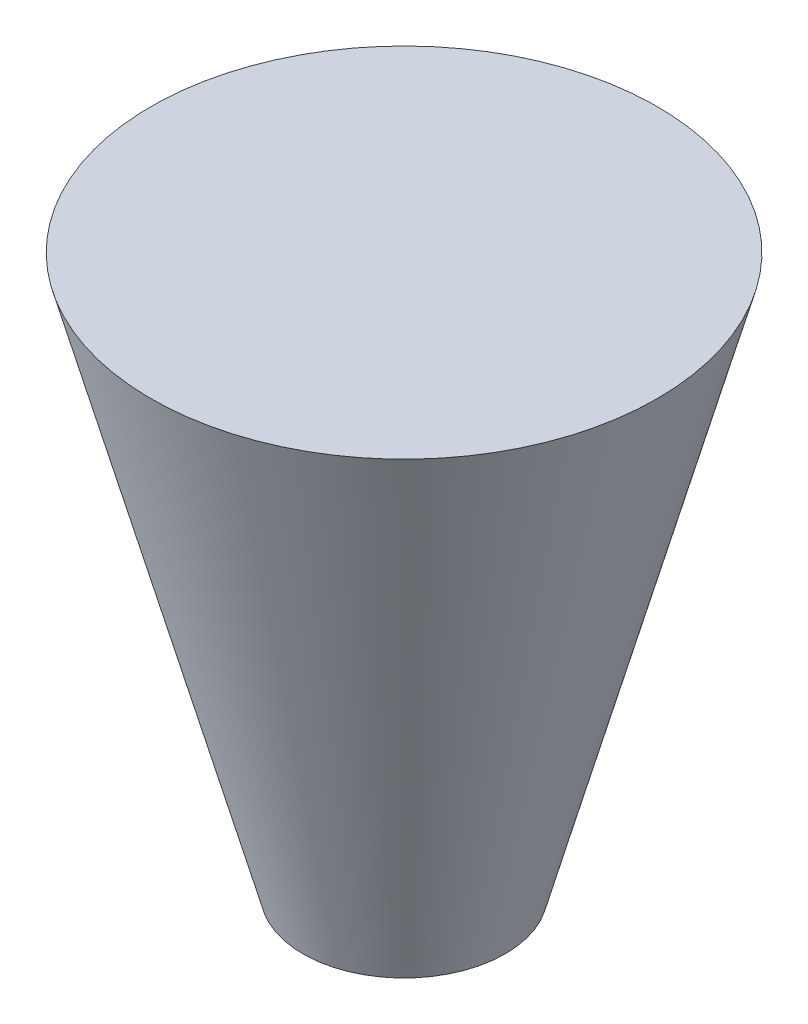
ISO-10303-21;
HEADER;
FILE_DESCRIPTION(('STEP AP214'),'2;1');
FILE_NAME('part.step','',(''),(''),'','','');
FILE_SCHEMA(('AUTOMOTIVE_DESIGN { 1 0 10303 214 1 1 1 1 }'));
ENDSEC;
DATA;
#1=APPLICATION_CONTEXT('core data for automotive mechanical design processes');
#2=APPLICATION_PROTOCOL_DEFINITION('international standard','automotive_design',2000,#1);
#3=PRODUCT_CONTEXT('',#1,'mechanical');
#4=PRODUCT('Part','Part','',(#3));
#5=PRODUCT_RELATED_PRODUCT_CATEGORY('part','',(#4));
#6=PRODUCT_DEFINITION_FORMATION('','',#4);
#7=PRODUCT_DEFINITION_CONTEXT('part definition',#1,'design');
#8=PRODUCT_DEFINITION('design','',#6,#7);
#9=PRODUCT_DEFINITION_SHAPE('','',#8);
#10=(LENGTH_UNIT() NAMED_UNIT(*) SI_UNIT(.MILLI.,.METRE.));
#11=(NAMED_UNIT(*) PLANE_ANGLE_UNIT() SI_UNIT($,.RADIAN.));
#12=(NAMED_UNIT(*) SI_UNIT($,.STERADIAN.) SOLID_ANGLE_UNIT());
#13=UNCERTAINTY_MEASURE_WITH_UNIT(LENGTH_MEASURE(1.E-05),#10,'distance_accuracy_value','');
#14=(GEOMETRIC_REPRESENTATION_CONTEXT(3) GLOBAL_UNCERTAINTY_ASSIGNED_CONTEXT((#13)) GLOBAL_UNIT_ASSIGNED_CONTEXT((#10,
#11,#12)) REPRESENTATION_CONTEXT('',''));
#15=CARTESIAN_POINT('',(0.,0.,0.));
#16=DIRECTION('',(0.,0.,1.));
#17=DIRECTION('',(1.,0.,0.));
#18=AXIS2_PLACEMENT_3D('',#15,#16,#17);
#19=CARTESIAN_POINT('',(0.,-50.,0.));
#20=DIRECTION('',(0.,1.,0.));
#21=DIRECTION('',(-1.,0.,0.));
#22=AXIS2_PLACEMENT_3D('',#19,#20,#21);
#23=PLANE('',#22);
#24=CARTESIAN_POINT('',(0.,-50.,0.));
#25=DIRECTION('',(0.,-1.,0.));
#26=DIRECTION('',(1.,0.,0.));
#27=AXIS2_PLACEMENT_3D('',#24,#25,#26);
#28=CIRCLE('',#27,20.);
#29=CARTESIAN_POINT('',(20.,-50.,0.));
#30=VERTEX_POINT('',#29);
#31=EDGE_CURVE('E10',#30,#30,#28,.T.);
#32=ORIENTED_EDGE('',*,*,#31,.T.);
#33=EDGE_LOOP('',(#32));
#34=FACE_BOUND('',#33,.T.);
#35=ADVANCED_FACE('F31',(#34),#23,.F.);
#36=CARTESIAN_POINT('',(0.,60.,0.));
#37=DIRECTION('',(0.,1.,0.));
#38=DIRECTION('',(-1.,0.,0.));
#39=AXIS2_PLACEMENT_3D('',#36,#37,#38);
#40=CONICAL_SURFACE('',#39,50.,0.266252049150925);
#41=ORIENTED_EDGE('',*,*,#31,.F.);
#42=EDGE_LOOP('',(#41));
#43=FACE_BOUND('',#42,.T.);
#44=CARTESIAN_POINT('',(0.,60.,0.));
#45=DIRECTION('',(0.,-1.,0.));
#46=DIRECTION('',(1.,0.,0.));
#47=AXIS2_PLACEMENT_3D('',#44,#45,#46);
#48=CIRCLE('',#47,50.);
#49=CARTESIAN_POINT('',(50.,60.,0.));
#50=VERTEX_POINT('',#49);
#51=EDGE_CURVE('E37',#50,#50,#48,.T.);
#52=ORIENTED_EDGE('',*,*,#51,.T.);
#53=EDGE_LOOP('',(#52));
#54=FACE_BOUND('',#53,.T.);
#55=ADVANCED_FACE('F43',(#43,#54),#40,.T.);
#56=CARTESIAN_POINT('',(-50.,60.,0.));
#57=DIRECTION('',(0.,-1.,0.));
#58=DIRECTION('',(1.,0.,0.));
#59=AXIS2_PLACEMENT_3D('',#56,#57,#58);
#60=PLANE('',#59);
#61=ORIENTED_EDGE('',*,*,#51,.F.);
#62=EDGE_LOOP('',(#61));
#63=FACE_BOUND('',#62,.T.);
#64=ADVANCED_FACE('F45',(#63),#60,.F.);
#65=CLOSED_SHELL('',(#35,#55,#64));
#66=MANIFOLD_SOLID_BREP('B2',#65);
#67=ADVANCED_BREP_SHAPE_REPRESENTATION('',(#18,#66),#14);
#68=SHAPE_DEFINITION_REPRESENTATION(#9,#67);
ENDSEC;
END-ISO-10303-21;
